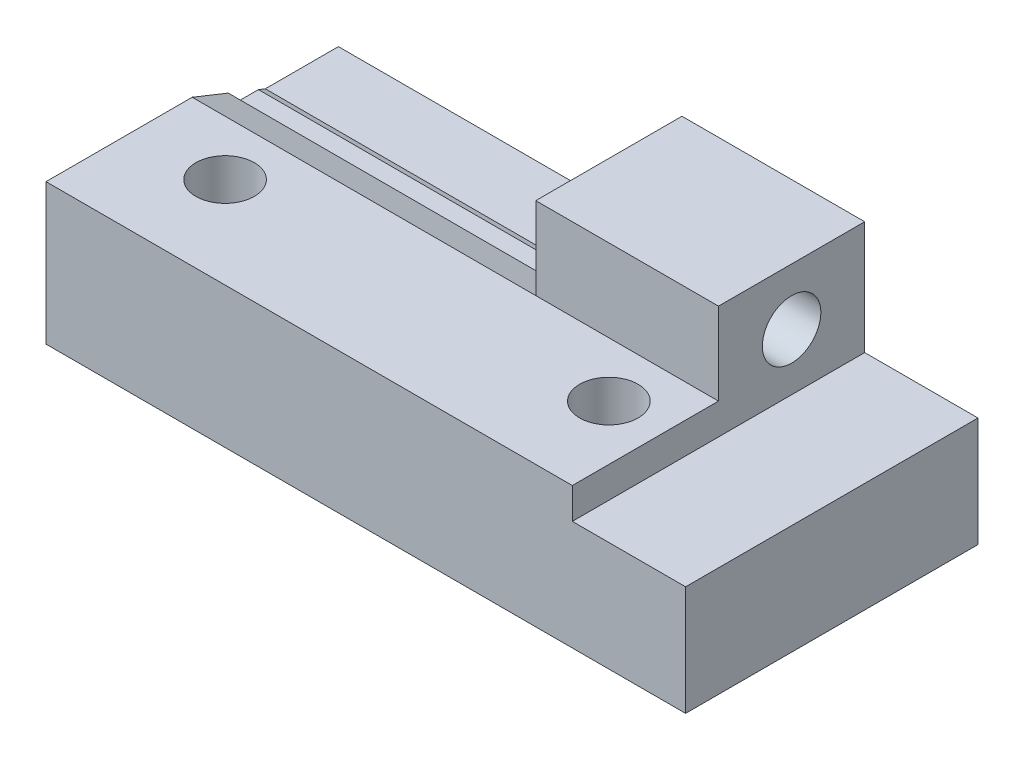
ISO-10303-21;
HEADER;
FILE_DESCRIPTION(('STEP AP214'),'2;1');
FILE_NAME('part.step','',(''),(''),'','','');
FILE_SCHEMA(('AUTOMOTIVE_DESIGN { 1 0 10303 214 1 1 1 1 }'));
ENDSEC;
DATA;
#1=APPLICATION_CONTEXT('core data for automotive mechanical design processes');
#2=APPLICATION_PROTOCOL_DEFINITION('international standard','automotive_design',2000,#1);
#3=PRODUCT_CONTEXT('',#1,'mechanical');
#4=PRODUCT('Part','Part','',(#3));
#5=PRODUCT_RELATED_PRODUCT_CATEGORY('part','',(#4));
#6=PRODUCT_DEFINITION_FORMATION('','',#4);
#7=PRODUCT_DEFINITION_CONTEXT('part definition',#1,'design');
#8=PRODUCT_DEFINITION('design','',#6,#7);
#9=PRODUCT_DEFINITION_SHAPE('','',#8);
#10=(LENGTH_UNIT() NAMED_UNIT(*) SI_UNIT(.MILLI.,.METRE.));
#11=(NAMED_UNIT(*) PLANE_ANGLE_UNIT() SI_UNIT($,.RADIAN.));
#12=(NAMED_UNIT(*) SI_UNIT($,.STERADIAN.) SOLID_ANGLE_UNIT());
#13=UNCERTAINTY_MEASURE_WITH_UNIT(LENGTH_MEASURE(1.E-05),#10,'distance_accuracy_value','');
#14=(GEOMETRIC_REPRESENTATION_CONTEXT(3) GLOBAL_UNCERTAINTY_ASSIGNED_CONTEXT((#13)) GLOBAL_UNIT_ASSIGNED_CONTEXT((#10,
#11,#12)) REPRESENTATION_CONTEXT('',''));
#15=CARTESIAN_POINT('',(0.,0.,0.));
#16=DIRECTION('',(0.,0.,1.));
#17=DIRECTION('',(1.,0.,0.));
#18=AXIS2_PLACEMENT_3D('',#15,#16,#17);
#19=CARTESIAN_POINT('',(-35.00105,9.1,4.));
#20=DIRECTION('',(1.,0.,0.));
#21=DIRECTION('',(0.,1.,0.));
#22=AXIS2_PLACEMENT_3D('',#19,#20,#21);
#23=CYLINDRICAL_SURFACE('',#22,1.6);
#24=CARTESIAN_POINT('',(-6.2,9.1,4.));
#25=DIRECTION('',(1.,0.,0.));
#26=DIRECTION('',(0.,1.,0.));
#27=AXIS2_PLACEMENT_3D('',#24,#25,#26);
#28=CIRCLE('',#27,1.6);
#29=CARTESIAN_POINT('',(-6.2,10.7,4.));
#30=VERTEX_POINT('',#29);
#31=EDGE_CURVE('E450',#30,#30,#28,.T.);
#32=ORIENTED_EDGE('',*,*,#31,.T.);
#33=EDGE_LOOP('',(#32));
#34=FACE_BOUND('',#33,.T.);
#35=CARTESIAN_POINT('',(-13.2,9.1,4.));
#36=DIRECTION('',(-1.,0.,0.));
#37=DIRECTION('',(0.,0.,1.));
#38=AXIS2_PLACEMENT_3D('',#35,#36,#37);
#39=CIRCLE('',#38,1.6);
#40=CARTESIAN_POINT('',(-13.2,9.1,5.6));
#41=VERTEX_POINT('',#40);
#42=EDGE_CURVE('E36',#41,#41,#39,.F.);
#43=ORIENTED_EDGE('',*,*,#42,.F.);
#44=EDGE_LOOP('',(#43));
#45=FACE_BOUND('',#44,.T.);
#46=ADVANCED_FACE('F32',(#34,#45),#23,.F.);
#47=CARTESIAN_POINT('',(-35.,12.2,8.));
#48=DIRECTION('',(1.,0.,0.));
#49=DIRECTION('',(0.,0.,-1.));
#50=AXIS2_PLACEMENT_3D('',#47,#48,#49);
#51=PLANE('',#50);
#52=DIRECTION('',(0.,0.,-1.));
#53=VECTOR('',#52,1.);
#54=CARTESIAN_POINT('',(-35.,6.25,2.35455173280956));
#55=LINE('',#54,#53);
#56=CARTESIAN_POINT('',(-35.,6.25,5.64544826719044));
#57=VERTEX_POINT('',#56);
#58=CARTESIAN_POINT('',(-35.,6.25,4.375));
#59=VERTEX_POINT('',#58);
#60=EDGE_CURVE('E287',#57,#59,#55,.T.);
#61=ORIENTED_EDGE('',*,*,#60,.T.);
#62=DIRECTION('',(0.,0.371390676354103,0.92847669088526));
#63=VECTOR('',#62,1.);
#64=CARTESIAN_POINT('',(-35.,7.7,8.));
#65=LINE('',#64,#63);
#66=CARTESIAN_POINT('',(-35.,6.1,4.));
#67=VERTEX_POINT('',#66);
#68=EDGE_CURVE('E324',#67,#59,#65,.T.);
#69=ORIENTED_EDGE('',*,*,#68,.F.);
#70=DIRECTION('',(0.,0.,1.));
#71=VECTOR('',#70,1.);
#72=CARTESIAN_POINT('',(-35.,6.1,4.));
#73=LINE('',#72,#71);
#74=CARTESIAN_POINT('',(-35.,6.1,0.));
#75=VERTEX_POINT('',#74);
#76=EDGE_CURVE('E328',#75,#67,#73,.T.);
#77=ORIENTED_EDGE('',*,*,#76,.F.);
#78=DIRECTION('',(0.,-1.,0.));
#79=VECTOR('',#78,1.);
#80=CARTESIAN_POINT('',(-35.,12.2,0.));
#81=LINE('',#80,#79);
#82=CARTESIAN_POINT('',(-35.,0.,0.));
#83=VERTEX_POINT('',#82);
#84=EDGE_CURVE('E581',#75,#83,#81,.T.);
#85=ORIENTED_EDGE('',*,*,#84,.T.);
#86=DIRECTION('',(0.,0.,-1.));
#87=VECTOR('',#86,1.);
#88=CARTESIAN_POINT('',(-35.,0.,8.));
#89=LINE('',#88,#87);
#90=CARTESIAN_POINT('',(-35.,0.,16.));
#91=VERTEX_POINT('',#90);
#92=EDGE_CURVE('E583',#91,#83,#89,.T.);
#93=ORIENTED_EDGE('',*,*,#92,.F.);
#94=DIRECTION('',(0.,-1.,0.));
#95=VECTOR('',#94,1.);
#96=CARTESIAN_POINT('',(-35.,7.7,16.));
#97=LINE('',#96,#95);
#98=CARTESIAN_POINT('',(-35.,7.7,16.));
#99=VERTEX_POINT('',#98);
#100=EDGE_CURVE('E454',#99,#91,#97,.T.);
#101=ORIENTED_EDGE('',*,*,#100,.F.);
#102=DIRECTION('',(0.,0.,-1.));
#103=VECTOR('',#102,1.);
#104=CARTESIAN_POINT('',(-35.,7.7,16.));
#105=LINE('',#104,#103);
#106=CARTESIAN_POINT('',(-35.,7.7,8.));
#107=VERTEX_POINT('',#106);
#108=EDGE_CURVE('E470',#99,#107,#105,.T.);
#109=ORIENTED_EDGE('',*,*,#108,.T.);
#110=CARTESIAN_POINT('',(-35.,6.91077988456844,6.02694971142112));
#111=VERTEX_POINT('',#110);
#112=EDGE_CURVE('E327',#111,#107,#65,.T.);
#113=ORIENTED_EDGE('',*,*,#112,.F.);
#114=DIRECTION('',(0.,-0.866025403784439,-0.5));
#115=VECTOR('',#114,1.);
#116=CARTESIAN_POINT('',(-35.,6.25,5.64544826719044));
#117=LINE('',#116,#115);
#118=EDGE_CURVE('E49',#111,#57,#117,.T.);
#119=ORIENTED_EDGE('',*,*,#118,.T.);
#120=EDGE_LOOP('',(#61,#69,#77,#85,#93,#101,#109,#113,#119));
#121=FACE_BOUND('',#120,.T.);
#122=ADVANCED_FACE('F514',(#121),#51,.F.);
#123=CARTESIAN_POINT('',(-16.2,6.,8.));
#124=DIRECTION('',(-1.,0.,0.));
#125=DIRECTION('',(0.,-1.,0.));
#126=AXIS2_PLACEMENT_3D('',#123,#124,#125);
#127=PLANE('',#126);
#128=DIRECTION('',(0.,0.866025403784439,-0.5));
#129=VECTOR('',#128,1.);
#130=CARTESIAN_POINT('',(-16.2,9.1,7.29089653438087));
#131=LINE('',#130,#129);
#132=CARTESIAN_POINT('',(-16.2,9.1,7.29089653438087));
#133=VERTEX_POINT('',#132);
#134=CARTESIAN_POINT('',(-16.2,11.95,5.64544826719043));
#135=VERTEX_POINT('',#134);
#136=EDGE_CURVE('E264',#133,#135,#131,.T.);
#137=ORIENTED_EDGE('',*,*,#136,.F.);
#138=DIRECTION('',(0.,0.866025403784439,0.5));
#139=VECTOR('',#138,1.);
#140=CARTESIAN_POINT('',(-16.2,6.25,5.64544826719044));
#141=LINE('',#140,#139);
#142=CARTESIAN_POINT('',(-16.2,6.91077988456844,6.02694971142112));
#143=VERTEX_POINT('',#142);
#144=EDGE_CURVE('E284',#143,#133,#141,.T.);
#145=ORIENTED_EDGE('',*,*,#144,.F.);
#146=DIRECTION('',(0.,-0.371390676354103,-0.92847669088526));
#147=VECTOR('',#146,1.);
#148=CARTESIAN_POINT('',(-16.2,7.7,8.));
#149=LINE('',#148,#147);
#150=CARTESIAN_POINT('',(-16.2,7.7,8.));
#151=VERTEX_POINT('',#150);
#152=EDGE_CURVE('E314',#151,#143,#149,.T.);
#153=ORIENTED_EDGE('',*,*,#152,.F.);
#154=DIRECTION('',(0.,-1.,0.));
#155=VECTOR('',#154,1.);
#156=CARTESIAN_POINT('',(-16.2,7.69999999999999,8.));
#157=LINE('',#156,#155);
#158=CARTESIAN_POINT('',(-16.2,12.2,8.));
#159=VERTEX_POINT('',#158);
#160=EDGE_CURVE('E309',#159,#151,#157,.T.);
#161=ORIENTED_EDGE('',*,*,#160,.F.);
#162=DIRECTION('',(0.,0.,1.));
#163=VECTOR('',#162,1.);
#164=CARTESIAN_POINT('',(-16.2,12.2,8.));
#165=LINE('',#164,#163);
#166=CARTESIAN_POINT('',(-16.2,12.2,0.));
#167=VERTEX_POINT('',#166);
#168=EDGE_CURVE('E342',#167,#159,#165,.T.);
#169=ORIENTED_EDGE('',*,*,#168,.F.);
#170=DIRECTION('',(0.,1.,0.));
#171=VECTOR('',#170,1.);
#172=CARTESIAN_POINT('',(-16.2,12.2,0.));
#173=LINE('',#172,#171);
#174=CARTESIAN_POINT('',(-16.2,6.1,0.));
#175=VERTEX_POINT('',#174);
#176=EDGE_CURVE('E345',#175,#167,#173,.T.);
#177=ORIENTED_EDGE('',*,*,#176,.F.);
#178=DIRECTION('',(0.,0.,-1.));
#179=VECTOR('',#178,1.);
#180=CARTESIAN_POINT('',(-16.2,6.1,4.));
#181=LINE('',#180,#179);
#182=CARTESIAN_POINT('',(-16.2,6.1,4.));
#183=VERTEX_POINT('',#182);
#184=EDGE_CURVE('E303',#183,#175,#181,.T.);
#185=ORIENTED_EDGE('',*,*,#184,.F.);
#186=CARTESIAN_POINT('',(-16.2,6.25,4.37500000000001));
#187=VERTEX_POINT('',#186);
#188=EDGE_CURVE('E305',#187,#183,#149,.T.);
#189=ORIENTED_EDGE('',*,*,#188,.F.);
#190=DIRECTION('',(0.,0.,1.));
#191=VECTOR('',#190,1.);
#192=CARTESIAN_POINT('',(-16.2,6.25,2.35455173280956));
#193=LINE('',#192,#191);
#194=CARTESIAN_POINT('',(-16.2,6.25,2.35455173280956));
#195=VERTEX_POINT('',#194);
#196=EDGE_CURVE('E277',#195,#187,#193,.T.);
#197=ORIENTED_EDGE('',*,*,#196,.F.);
#198=DIRECTION('',(0.,-0.866025403784439,0.5));
#199=VECTOR('',#198,1.);
#200=CARTESIAN_POINT('',(-16.2,9.1,0.709103465619133));
#201=LINE('',#200,#199);
#202=CARTESIAN_POINT('',(-16.2,9.1,0.709103465619133));
#203=VERTEX_POINT('',#202);
#204=EDGE_CURVE('E275',#203,#195,#201,.T.);
#205=ORIENTED_EDGE('',*,*,#204,.F.);
#206=DIRECTION('',(0.,-0.866025403784439,-0.5));
#207=VECTOR('',#206,1.);
#208=CARTESIAN_POINT('',(-16.2,11.95,2.35455173280957));
#209=LINE('',#208,#207);
#210=CARTESIAN_POINT('',(-16.2,11.95,2.35455173280957));
#211=VERTEX_POINT('',#210);
#212=EDGE_CURVE('E242',#211,#203,#209,.T.);
#213=ORIENTED_EDGE('',*,*,#212,.F.);
#214=DIRECTION('',(0.,0.,-1.));
#215=VECTOR('',#214,1.);
#216=CARTESIAN_POINT('',(-16.2,11.95,5.64544826719043));
#217=LINE('',#216,#215);
#218=EDGE_CURVE('E261',#135,#211,#217,.T.);
#219=ORIENTED_EDGE('',*,*,#218,.F.);
#220=EDGE_LOOP('',(#137,#145,#153,#161,#169,#177,#185,#189,#197,#205,#213,#219));
#221=FACE_BOUND('',#220,.T.);
#222=ADVANCED_FACE('F521',(#221),#127,.T.);
#223=CARTESIAN_POINT('',(3.86031808642252,7.7,8.));
#224=DIRECTION('',(0.,-0.92847669088526,0.371390676354103));
#225=DIRECTION('',(0.,-0.371390676354103,-0.92847669088526));
#226=AXIS2_PLACEMENT_3D('',#223,#224,#225);
#227=PLANE('',#226);
#228=DIRECTION('',(1.,0.,0.));
#229=VECTOR('',#228,1.);
#230=CARTESIAN_POINT('',(-35.00105,6.25,4.375));
#231=LINE('',#230,#229);
#232=EDGE_CURVE('E291',#59,#187,#231,.T.);
#233=ORIENTED_EDGE('',*,*,#232,.T.);
#234=ORIENTED_EDGE('',*,*,#188,.T.);
#235=DIRECTION('',(-1.,0.,0.));
#236=VECTOR('',#235,1.);
#237=CARTESIAN_POINT('',(3.86031808642252,6.1,4.));
#238=LINE('',#237,#236);
#239=EDGE_CURVE('E321',#183,#67,#238,.T.);
#240=ORIENTED_EDGE('',*,*,#239,.T.);
#241=ORIENTED_EDGE('',*,*,#68,.T.);
#242=EDGE_LOOP('',(#233,#234,#240,#241));
#243=FACE_BOUND('',#242,.T.);
#244=ADVANCED_FACE('F616',(#243),#227,.F.);
#245=DIRECTION('',(-1.,0.,0.));
#246=VECTOR('',#245,1.);
#247=CARTESIAN_POINT('',(-35.00105,6.91077988456844,6.02694971142112));
#248=LINE('',#247,#246);
#249=EDGE_CURVE('E294',#143,#111,#248,.T.);
#250=ORIENTED_EDGE('',*,*,#249,.T.);
#251=ORIENTED_EDGE('',*,*,#112,.T.);
#252=DIRECTION('',(-1.,0.,0.));
#253=VECTOR('',#252,1.);
#254=CARTESIAN_POINT('',(3.86031808642252,7.7,8.));
#255=LINE('',#254,#253);
#256=EDGE_CURVE('E306',#151,#107,#255,.T.);
#257=ORIENTED_EDGE('',*,*,#256,.F.);
#258=ORIENTED_EDGE('',*,*,#152,.T.);
#259=EDGE_LOOP('',(#250,#251,#257,#258));
#260=FACE_BOUND('',#259,.T.);
#261=ADVANCED_FACE('F542',(#260),#227,.F.);
#262=CARTESIAN_POINT('',(-6.2,12.2,8.));
#263=DIRECTION('',(0.,-1.,0.));
#264=DIRECTION('',(1.,0.,0.));
#265=AXIS2_PLACEMENT_3D('',#262,#263,#264);
#266=PLANE('',#265);
#267=ORIENTED_EDGE('',*,*,#168,.T.);
#268=DIRECTION('',(-1.,0.,0.));
#269=VECTOR('',#268,1.);
#270=CARTESIAN_POINT('',(-6.2,12.2,8.));
#271=LINE('',#270,#269);
#272=CARTESIAN_POINT('',(-6.2,12.2,8.));
#273=VERTEX_POINT('',#272);
#274=EDGE_CURVE('E587',#273,#159,#271,.T.);
#275=ORIENTED_EDGE('',*,*,#274,.F.);
#276=DIRECTION('',(0.,0.,-1.));
#277=VECTOR('',#276,1.);
#278=CARTESIAN_POINT('',(-6.2,12.2,8.));
#279=LINE('',#278,#277);
#280=CARTESIAN_POINT('',(-6.2,12.2,0.));
#281=VERTEX_POINT('',#280);
#282=EDGE_CURVE('E586',#273,#281,#279,.T.);
#283=ORIENTED_EDGE('',*,*,#282,.T.);
#284=DIRECTION('',(-1.,0.,0.));
#285=VECTOR('',#284,1.);
#286=CARTESIAN_POINT('',(-6.2,12.2,0.));
#287=LINE('',#286,#285);
#288=EDGE_CURVE('E575',#281,#167,#287,.T.);
#289=ORIENTED_EDGE('',*,*,#288,.T.);
#290=EDGE_LOOP('',(#267,#275,#283,#289));
#291=FACE_BOUND('',#290,.T.);
#292=ADVANCED_FACE('F509',(#291),#266,.F.);
#293=CARTESIAN_POINT('',(0.,0.,8.));
#294=DIRECTION('',(0.,0.,1.));
#295=DIRECTION('',(1.,0.,0.));
#296=AXIS2_PLACEMENT_3D('',#293,#294,#295);
#297=PLANE('',#296);
#298=ORIENTED_EDGE('',*,*,#274,.T.);
#299=ORIENTED_EDGE('',*,*,#160,.T.);
#300=DIRECTION('',(-1.,0.,0.));
#301=VECTOR('',#300,1.);
#302=CARTESIAN_POINT('',(-6.2,7.7,8.));
#303=LINE('',#302,#301);
#304=CARTESIAN_POINT('',(-6.2,7.7,8.));
#305=VERTEX_POINT('',#304);
#306=EDGE_CURVE('E453',#305,#151,#303,.T.);
#307=ORIENTED_EDGE('',*,*,#306,.F.);
#308=DIRECTION('',(0.,1.,0.));
#309=VECTOR('',#308,1.);
#310=CARTESIAN_POINT('',(-6.2,6.,8.));
#311=LINE('',#310,#309);
#312=EDGE_CURVE('E479',#305,#273,#311,.T.);
#313=ORIENTED_EDGE('',*,*,#312,.T.);
#314=EDGE_LOOP('',(#298,#299,#307,#313));
#315=FACE_BOUND('',#314,.T.);
#316=ADVANCED_FACE('F499',(#315),#297,.T.);
#317=CARTESIAN_POINT('',(-9.2,-0.001000000000001,11.));
#318=DIRECTION('',(0.,1.,0.));
#319=DIRECTION('',(-1.,0.,0.));
#320=AXIS2_PLACEMENT_3D('',#317,#318,#319);
#321=CYLINDRICAL_SURFACE('',#320,1.6);
#322=CARTESIAN_POINT('',(-9.2,7.7,11.));
#323=DIRECTION('',(0.,1.,0.));
#324=DIRECTION('',(-1.,0.,0.));
#325=AXIS2_PLACEMENT_3D('',#322,#323,#324);
#326=CIRCLE('',#325,1.6);
#327=CARTESIAN_POINT('',(-10.8,7.7,11.));
#328=VERTEX_POINT('',#327);
#329=EDGE_CURVE('E444',#328,#328,#326,.T.);
#330=ORIENTED_EDGE('',*,*,#329,.T.);
#331=EDGE_LOOP('',(#330));
#332=FACE_BOUND('',#331,.T.);
#333=CARTESIAN_POINT('',(-9.2,3.,11.));
#334=DIRECTION('',(0.,-1.,0.));
#335=DIRECTION('',(0.,0.,-1.));
#336=AXIS2_PLACEMENT_3D('',#333,#334,#335);
#337=CIRCLE('',#336,1.6);
#338=CARTESIAN_POINT('',(-9.2,3.,9.4));
#339=VERTEX_POINT('',#338);
#340=EDGE_CURVE('E385',#339,#339,#337,.F.);
#341=ORIENTED_EDGE('',*,*,#340,.F.);
#342=EDGE_LOOP('',(#341));
#343=FACE_BOUND('',#342,.T.);
#344=ADVANCED_FACE('F496',(#332,#343),#321,.F.);
#345=CARTESIAN_POINT('',(-30.2,-0.0010000000000036,11.));
#346=DIRECTION('',(0.,1.,0.));
#347=DIRECTION('',(-1.,0.,0.));
#348=AXIS2_PLACEMENT_3D('',#345,#346,#347);
#349=CYLINDRICAL_SURFACE('',#348,1.6);
#350=CARTESIAN_POINT('',(-30.2,7.7,11.));
#351=DIRECTION('',(0.,1.,0.));
#352=DIRECTION('',(-1.,0.,0.));
#353=AXIS2_PLACEMENT_3D('',#350,#351,#352);
#354=CIRCLE('',#353,1.6);
#355=CARTESIAN_POINT('',(-31.8,7.7,11.));
#356=VERTEX_POINT('',#355);
#357=EDGE_CURVE('E447',#356,#356,#354,.T.);
#358=ORIENTED_EDGE('',*,*,#357,.T.);
#359=EDGE_LOOP('',(#358));
#360=FACE_BOUND('',#359,.T.);
#361=CARTESIAN_POINT('',(-30.2,3.,11.));
#362=DIRECTION('',(0.,-1.,0.));
#363=DIRECTION('',(0.,0.,-1.));
#364=AXIS2_PLACEMENT_3D('',#361,#362,#363);
#365=CIRCLE('',#364,1.6);
#366=CARTESIAN_POINT('',(-30.2,3.,9.4));
#367=VERTEX_POINT('',#366);
#368=EDGE_CURVE('E433',#367,#367,#365,.F.);
#369=ORIENTED_EDGE('',*,*,#368,.F.);
#370=EDGE_LOOP('',(#369));
#371=FACE_BOUND('',#370,.T.);
#372=ADVANCED_FACE('F498',(#360,#371),#349,.F.);
#373=CARTESIAN_POINT('',(-35.,0.,8.));
#374=DIRECTION('',(0.,1.,0.));
#375=DIRECTION('',(0.,0.,1.));
#376=AXIS2_PLACEMENT_3D('',#373,#374,#375);
#377=PLANE('',#376);
#378=DIRECTION('',(0.5,0.,-0.866025403784439));
#379=VECTOR('',#378,1.);
#380=CARTESIAN_POINT('',(-12.4908965343809,0.,11.));
#381=LINE('',#380,#379);
#382=CARTESIAN_POINT('',(-12.4908965343809,0.,11.));
#383=VERTEX_POINT('',#382);
#384=CARTESIAN_POINT('',(-10.8454482671904,0.,8.15));
#385=VERTEX_POINT('',#384);
#386=EDGE_CURVE('E369',#383,#385,#381,.T.);
#387=ORIENTED_EDGE('',*,*,#386,.F.);
#388=DIRECTION('',(-0.499999999999999,0.,-0.866025403784439));
#389=VECTOR('',#388,1.);
#390=CARTESIAN_POINT('',(-10.8454482671904,0.,13.85));
#391=LINE('',#390,#389);
#392=CARTESIAN_POINT('',(-10.8454482671904,0.,13.85));
#393=VERTEX_POINT('',#392);
#394=EDGE_CURVE('E57',#393,#383,#391,.T.);
#395=ORIENTED_EDGE('',*,*,#394,.F.);
#396=DIRECTION('',(-1.,0.,0.));
#397=VECTOR('',#396,1.);
#398=CARTESIAN_POINT('',(-7.55455173280957,0.,13.85));
#399=LINE('',#398,#397);
#400=CARTESIAN_POINT('',(-7.55455173280957,0.,13.85));
#401=VERTEX_POINT('',#400);
#402=EDGE_CURVE('E352',#401,#393,#399,.T.);
#403=ORIENTED_EDGE('',*,*,#402,.F.);
#404=DIRECTION('',(-0.5,0.,0.866025403784438));
#405=VECTOR('',#404,1.);
#406=CARTESIAN_POINT('',(-5.90910346561914,0.,11.));
#407=LINE('',#406,#405);
#408=CARTESIAN_POINT('',(-5.90910346561914,0.,11.));
#409=VERTEX_POINT('',#408);
#410=EDGE_CURVE('E378',#409,#401,#407,.T.);
#411=ORIENTED_EDGE('',*,*,#410,.F.);
#412=DIRECTION('',(0.5,0.,0.866025403784439));
#413=VECTOR('',#412,1.);
#414=CARTESIAN_POINT('',(-7.55455173280957,0.,8.15));
#415=LINE('',#414,#413);
#416=CARTESIAN_POINT('',(-7.55455173280957,0.,8.15));
#417=VERTEX_POINT('',#416);
#418=EDGE_CURVE('E375',#417,#409,#415,.T.);
#419=ORIENTED_EDGE('',*,*,#418,.F.);
#420=DIRECTION('',(1.,0.,0.));
#421=VECTOR('',#420,1.);
#422=CARTESIAN_POINT('',(-10.8454482671904,0.,8.15));
#423=LINE('',#422,#421);
#424=EDGE_CURVE('E372',#385,#417,#423,.T.);
#425=ORIENTED_EDGE('',*,*,#424,.F.);
#426=EDGE_LOOP('',(#387,#395,#403,#411,#419,#425));
#427=FACE_BOUND('',#426,.T.);
#428=DIRECTION('',(0.500000000000001,0.,-0.866025403784438));
#429=VECTOR('',#428,1.);
#430=CARTESIAN_POINT('',(-33.4908965343809,0.,11.));
#431=LINE('',#430,#429);
#432=CARTESIAN_POINT('',(-33.4908965343809,0.,11.));
#433=VERTEX_POINT('',#432);
#434=CARTESIAN_POINT('',(-31.8454482671904,0.,8.15));
#435=VERTEX_POINT('',#434);
#436=EDGE_CURVE('E417',#433,#435,#431,.T.);
#437=ORIENTED_EDGE('',*,*,#436,.F.);
#438=DIRECTION('',(-0.499999999999999,0.,-0.866025403784439));
#439=VECTOR('',#438,1.);
#440=CARTESIAN_POINT('',(-31.8454482671904,0.,13.85));
#441=LINE('',#440,#439);
#442=CARTESIAN_POINT('',(-31.8454482671904,0.,13.85));
#443=VERTEX_POINT('',#442);
#444=EDGE_CURVE('E415',#443,#433,#441,.T.);
#445=ORIENTED_EDGE('',*,*,#444,.F.);
#446=DIRECTION('',(-1.,0.,0.));
#447=VECTOR('',#446,1.);
#448=CARTESIAN_POINT('',(-28.5545517328096,0.,13.85));
#449=LINE('',#448,#447);
#450=CARTESIAN_POINT('',(-28.5545517328096,0.,13.85));
#451=VERTEX_POINT('',#450);
#452=EDGE_CURVE('E399',#451,#443,#449,.T.);
#453=ORIENTED_EDGE('',*,*,#452,.F.);
#454=DIRECTION('',(-0.500000000000001,0.,0.866025403784438));
#455=VECTOR('',#454,1.);
#456=CARTESIAN_POINT('',(-26.9091034656191,0.,11.));
#457=LINE('',#456,#455);
#458=CARTESIAN_POINT('',(-26.9091034656191,0.,11.));
#459=VERTEX_POINT('',#458);
#460=EDGE_CURVE('E426',#459,#451,#457,.T.);
#461=ORIENTED_EDGE('',*,*,#460,.F.);
#462=DIRECTION('',(0.5,0.,0.866025403784438));
#463=VECTOR('',#462,1.);
#464=CARTESIAN_POINT('',(-28.5545517328096,0.,8.15));
#465=LINE('',#464,#463);
#466=CARTESIAN_POINT('',(-28.5545517328096,0.,8.15));
#467=VERTEX_POINT('',#466);
#468=EDGE_CURVE('E423',#467,#459,#465,.T.);
#469=ORIENTED_EDGE('',*,*,#468,.F.);
#470=DIRECTION('',(1.,0.,0.));
#471=VECTOR('',#470,1.);
#472=CARTESIAN_POINT('',(-31.8454482671904,0.,8.15));
#473=LINE('',#472,#471);
#474=EDGE_CURVE('E420',#435,#467,#473,.T.);
#475=ORIENTED_EDGE('',*,*,#474,.F.);
#476=EDGE_LOOP('',(#437,#445,#453,#461,#469,#475));
#477=FACE_BOUND('',#476,.T.);
#478=DIRECTION('',(1.,0.,0.));
#479=VECTOR('',#478,1.);
#480=CARTESIAN_POINT('',(-35.,0.,0.));
#481=LINE('',#480,#479);
#482=CARTESIAN_POINT('',(0.,0.,0.));
#483=VERTEX_POINT('',#482);
#484=EDGE_CURVE('E487',#83,#483,#481,.T.);
#485=ORIENTED_EDGE('',*,*,#484,.T.);
#486=DIRECTION('',(0.,0.,-1.));
#487=VECTOR('',#486,1.);
#488=CARTESIAN_POINT('',(0.,0.,8.));
#489=LINE('',#488,#487);
#490=CARTESIAN_POINT('',(0.,0.,16.));
#491=VERTEX_POINT('',#490);
#492=EDGE_CURVE('E12',#491,#483,#489,.T.);
#493=ORIENTED_EDGE('',*,*,#492,.F.);
#494=DIRECTION('',(1.,0.,0.));
#495=VECTOR('',#494,1.);
#496=CARTESIAN_POINT('',(-35.,0.,16.));
#497=LINE('',#496,#495);
#498=EDGE_CURVE('E457',#91,#491,#497,.T.);
#499=ORIENTED_EDGE('',*,*,#498,.F.);
#500=ORIENTED_EDGE('',*,*,#92,.T.);
#501=EDGE_LOOP('',(#485,#493,#499,#500));
#502=FACE_BOUND('',#501,.T.);
#503=ADVANCED_FACE('F34',(#427,#477,#502),#377,.F.);
#504=CARTESIAN_POINT('',(0.,0.,8.));
#505=DIRECTION('',(-1.,0.,0.));
#506=DIRECTION('',(0.,0.,1.));
#507=AXIS2_PLACEMENT_3D('',#504,#505,#506);
#508=PLANE('',#507);
#509=DIRECTION('',(0.,1.,0.));
#510=VECTOR('',#509,1.);
#511=CARTESIAN_POINT('',(0.,0.,0.));
#512=LINE('',#511,#510);
#513=CARTESIAN_POINT('',(0.,6.,0.));
#514=VERTEX_POINT('',#513);
#515=EDGE_CURVE('E558',#483,#514,#512,.T.);
#516=ORIENTED_EDGE('',*,*,#515,.T.);
#517=DIRECTION('',(0.,0.,-1.));
#518=VECTOR('',#517,1.);
#519=CARTESIAN_POINT('',(0.,6.,8.));
#520=LINE('',#519,#518);
#521=CARTESIAN_POINT('',(0.,6.,16.));
#522=VERTEX_POINT('',#521);
#523=EDGE_CURVE('E41',#522,#514,#520,.T.);
#524=ORIENTED_EDGE('',*,*,#523,.F.);
#525=DIRECTION('',(0.,1.,0.));
#526=VECTOR('',#525,1.);
#527=CARTESIAN_POINT('',(0.,0.,16.));
#528=LINE('',#527,#526);
#529=EDGE_CURVE('E460',#491,#522,#528,.T.);
#530=ORIENTED_EDGE('',*,*,#529,.F.);
#531=ORIENTED_EDGE('',*,*,#492,.T.);
#532=EDGE_LOOP('',(#516,#524,#530,#531));
#533=FACE_BOUND('',#532,.T.);
#534=ADVANCED_FACE('F549',(#533),#508,.F.);
#535=CARTESIAN_POINT('',(0.,6.,8.));
#536=DIRECTION('',(0.,-1.,0.));
#537=DIRECTION('',(1.,0.,0.));
#538=AXIS2_PLACEMENT_3D('',#535,#536,#537);
#539=PLANE('',#538);
#540=DIRECTION('',(-1.,0.,0.));
#541=VECTOR('',#540,1.);
#542=CARTESIAN_POINT('',(0.,6.,0.));
#543=LINE('',#542,#541);
#544=CARTESIAN_POINT('',(-6.2,6.,0.));
#545=VERTEX_POINT('',#544);
#546=EDGE_CURVE('E564',#514,#545,#543,.T.);
#547=ORIENTED_EDGE('',*,*,#546,.T.);
#548=DIRECTION('',(0.,0.,-1.));
#549=VECTOR('',#548,1.);
#550=CARTESIAN_POINT('',(-6.2,6.,8.));
#551=LINE('',#550,#549);
#552=CARTESIAN_POINT('',(-6.2,6.,16.));
#553=VERTEX_POINT('',#552);
#554=EDGE_CURVE('E568',#553,#545,#551,.T.);
#555=ORIENTED_EDGE('',*,*,#554,.F.);
#556=DIRECTION('',(-1.,0.,0.));
#557=VECTOR('',#556,1.);
#558=CARTESIAN_POINT('',(0.,6.,16.));
#559=LINE('',#558,#557);
#560=EDGE_CURVE('E463',#522,#553,#559,.T.);
#561=ORIENTED_EDGE('',*,*,#560,.F.);
#562=ORIENTED_EDGE('',*,*,#523,.T.);
#563=EDGE_LOOP('',(#547,#555,#561,#562));
#564=FACE_BOUND('',#563,.T.);
#565=ADVANCED_FACE('F546',(#564),#539,.F.);
#566=CARTESIAN_POINT('',(-6.2,6.,8.));
#567=DIRECTION('',(-1.,0.,0.));
#568=DIRECTION('',(0.,-1.,0.));
#569=AXIS2_PLACEMENT_3D('',#566,#567,#568);
#570=PLANE('',#569);
#571=ORIENTED_EDGE('',*,*,#31,.F.);
#572=EDGE_LOOP('',(#571));
#573=FACE_BOUND('',#572,.T.);
#574=DIRECTION('',(0.,1.,0.));
#575=VECTOR('',#574,1.);
#576=CARTESIAN_POINT('',(-6.2,6.,0.));
#577=LINE('',#576,#575);
#578=EDGE_CURVE('E573',#545,#281,#577,.T.);
#579=ORIENTED_EDGE('',*,*,#578,.T.);
#580=ORIENTED_EDGE('',*,*,#282,.F.);
#581=ORIENTED_EDGE('',*,*,#312,.F.);
#582=DIRECTION('',(0.,0.,-1.));
#583=VECTOR('',#582,1.);
#584=CARTESIAN_POINT('',(-6.2,7.7,16.));
#585=LINE('',#584,#583);
#586=CARTESIAN_POINT('',(-6.2,7.7,16.));
#587=VERTEX_POINT('',#586);
#588=EDGE_CURVE('E482',#587,#305,#585,.T.);
#589=ORIENTED_EDGE('',*,*,#588,.F.);
#590=DIRECTION('',(0.,1.,0.));
#591=VECTOR('',#590,1.);
#592=CARTESIAN_POINT('',(-6.2,6.,16.));
#593=LINE('',#592,#591);
#594=EDGE_CURVE('E466',#553,#587,#593,.T.);
#595=ORIENTED_EDGE('',*,*,#594,.F.);
#596=ORIENTED_EDGE('',*,*,#554,.T.);
#597=EDGE_LOOP('',(#579,#580,#581,#589,#595,#596));
#598=FACE_BOUND('',#597,.T.);
#599=ADVANCED_FACE('F537',(#573,#598),#570,.F.);
#600=CARTESIAN_POINT('',(0.,0.,0.));
#601=DIRECTION('',(0.,0.,1.));
#602=DIRECTION('',(1.,0.,0.));
#603=AXIS2_PLACEMENT_3D('',#600,#601,#602);
#604=PLANE('',#603);
#605=ORIENTED_EDGE('',*,*,#84,.F.);
#606=DIRECTION('',(-1.,0.,0.));
#607=VECTOR('',#606,1.);
#608=CARTESIAN_POINT('',(3.86031808642252,6.1,0.));
#609=LINE('',#608,#607);
#610=EDGE_CURVE('E333',#175,#75,#609,.T.);
#611=ORIENTED_EDGE('',*,*,#610,.F.);
#612=ORIENTED_EDGE('',*,*,#176,.T.);
#613=ORIENTED_EDGE('',*,*,#288,.F.);
#614=ORIENTED_EDGE('',*,*,#578,.F.);
#615=ORIENTED_EDGE('',*,*,#546,.F.);
#616=ORIENTED_EDGE('',*,*,#515,.F.);
#617=ORIENTED_EDGE('',*,*,#484,.F.);
#618=EDGE_LOOP('',(#605,#611,#612,#613,#614,#615,#616,#617));
#619=FACE_BOUND('',#618,.T.);
#620=ADVANCED_FACE('F533',(#619),#604,.F.);
#621=CARTESIAN_POINT('',(-6.2,7.7,16.));
#622=DIRECTION('',(0.,-1.,0.));
#623=DIRECTION('',(1.,0.,0.));
#624=AXIS2_PLACEMENT_3D('',#621,#622,#623);
#625=PLANE('',#624);
#626=ORIENTED_EDGE('',*,*,#329,.F.);
#627=EDGE_LOOP('',(#626));
#628=FACE_BOUND('',#627,.T.);
#629=ORIENTED_EDGE('',*,*,#357,.F.);
#630=EDGE_LOOP('',(#629));
#631=FACE_BOUND('',#630,.T.);
#632=ORIENTED_EDGE('',*,*,#306,.T.);
#633=ORIENTED_EDGE('',*,*,#256,.T.);
#634=ORIENTED_EDGE('',*,*,#108,.F.);
#635=DIRECTION('',(-1.,0.,0.));
#636=VECTOR('',#635,1.);
#637=CARTESIAN_POINT('',(-6.2,7.7,16.));
#638=LINE('',#637,#636);
#639=EDGE_CURVE('E468',#587,#99,#638,.T.);
#640=ORIENTED_EDGE('',*,*,#639,.F.);
#641=ORIENTED_EDGE('',*,*,#588,.T.);
#642=EDGE_LOOP('',(#632,#633,#634,#640,#641));
#643=FACE_BOUND('',#642,.T.);
#644=ADVANCED_FACE('F530',(#628,#631,#643),#625,.F.);
#645=CARTESIAN_POINT('',(-35.,0.,16.));
#646=DIRECTION('',(0.,0.,1.));
#647=DIRECTION('',(1.,0.,0.));
#648=AXIS2_PLACEMENT_3D('',#645,#646,#647);
#649=PLANE('',#648);
#650=ORIENTED_EDGE('',*,*,#100,.T.);
#651=ORIENTED_EDGE('',*,*,#498,.T.);
#652=ORIENTED_EDGE('',*,*,#529,.T.);
#653=ORIENTED_EDGE('',*,*,#560,.T.);
#654=ORIENTED_EDGE('',*,*,#594,.T.);
#655=ORIENTED_EDGE('',*,*,#639,.T.);
#656=EDGE_LOOP('',(#650,#651,#652,#653,#654,#655));
#657=FACE_BOUND('',#656,.T.);
#658=ADVANCED_FACE('F526',(#657),#649,.T.);
#659=CARTESIAN_POINT('',(-33.4908965343809,3.,11.));
#660=DIRECTION('',(0.,-1.,0.));
#661=DIRECTION('',(0.,0.,-1.));
#662=AXIS2_PLACEMENT_3D('',#659,#660,#661);
#663=PLANE('',#662);
#664=DIRECTION('',(-0.499999999999999,0.,-0.866025403784439));
#665=VECTOR('',#664,1.);
#666=CARTESIAN_POINT('',(-31.8454482671904,3.,13.85));
#667=LINE('',#666,#665);
#668=CARTESIAN_POINT('',(-31.8454482671904,3.,13.85));
#669=VERTEX_POINT('',#668);
#670=CARTESIAN_POINT('',(-33.4908965343809,3.,11.));
#671=VERTEX_POINT('',#670);
#672=EDGE_CURVE('E395',#669,#671,#667,.T.);
#673=ORIENTED_EDGE('',*,*,#672,.T.);
#674=DIRECTION('',(0.500000000000001,0.,-0.866025403784438));
#675=VECTOR('',#674,1.);
#676=CARTESIAN_POINT('',(-33.4908965343809,3.,11.));
#677=LINE('',#676,#675);
#678=CARTESIAN_POINT('',(-31.8454482671904,3.,8.15));
#679=VERTEX_POINT('',#678);
#680=EDGE_CURVE('E398',#671,#679,#677,.T.);
#681=ORIENTED_EDGE('',*,*,#680,.T.);
#682=DIRECTION('',(1.,0.,0.));
#683=VECTOR('',#682,1.);
#684=CARTESIAN_POINT('',(-31.8454482671904,3.,8.15));
#685=LINE('',#684,#683);
#686=CARTESIAN_POINT('',(-28.5545517328096,3.,8.15));
#687=VERTEX_POINT('',#686);
#688=EDGE_CURVE('E402',#679,#687,#685,.T.);
#689=ORIENTED_EDGE('',*,*,#688,.T.);
#690=DIRECTION('',(0.5,0.,0.866025403784438));
#691=VECTOR('',#690,1.);
#692=CARTESIAN_POINT('',(-28.5545517328096,3.,8.15));
#693=LINE('',#692,#691);
#694=CARTESIAN_POINT('',(-26.9091034656191,3.,11.));
#695=VERTEX_POINT('',#694);
#696=EDGE_CURVE('E405',#687,#695,#693,.T.);
#697=ORIENTED_EDGE('',*,*,#696,.T.);
#698=DIRECTION('',(-0.500000000000001,0.,0.866025403784438));
#699=VECTOR('',#698,1.);
#700=CARTESIAN_POINT('',(-26.9091034656191,3.,11.));
#701=LINE('',#700,#699);
#702=CARTESIAN_POINT('',(-28.5545517328096,3.,13.85));
#703=VERTEX_POINT('',#702);
#704=EDGE_CURVE('E408',#695,#703,#701,.T.);
#705=ORIENTED_EDGE('',*,*,#704,.T.);
#706=DIRECTION('',(-1.,0.,0.));
#707=VECTOR('',#706,1.);
#708=CARTESIAN_POINT('',(-28.5545517328096,3.,13.85));
#709=LINE('',#708,#707);
#710=EDGE_CURVE('E411',#703,#669,#709,.T.);
#711=ORIENTED_EDGE('',*,*,#710,.T.);
#712=EDGE_LOOP('',(#673,#681,#689,#697,#705,#711));
#713=FACE_BOUND('',#712,.T.);
#714=ORIENTED_EDGE('',*,*,#368,.T.);
#715=EDGE_LOOP('',(#714));
#716=FACE_BOUND('',#715,.T.);
#717=ADVANCED_FACE('F529',(#713,#716),#663,.T.);
#718=CARTESIAN_POINT('',(-31.8454482671904,3.,13.85));
#719=DIRECTION('',(-0.866025403784439,0.,0.499999999999999));
#720=DIRECTION('',(0.499999999999999,0.,0.866025403784439));
#721=AXIS2_PLACEMENT_3D('',#718,#719,#720);
#722=PLANE('',#721);
#723=ORIENTED_EDGE('',*,*,#444,.T.);
#724=DIRECTION('',(0.,-1.,0.));
#725=VECTOR('',#724,1.);
#726=CARTESIAN_POINT('',(-33.4908965343809,3.,11.));
#727=LINE('',#726,#725);
#728=EDGE_CURVE('E414',#671,#433,#727,.T.);
#729=ORIENTED_EDGE('',*,*,#728,.F.);
#730=ORIENTED_EDGE('',*,*,#672,.F.);
#731=DIRECTION('',(0.,-1.,0.));
#732=VECTOR('',#731,1.);
#733=CARTESIAN_POINT('',(-31.8454482671904,3.,13.85));
#734=LINE('',#733,#732);
#735=EDGE_CURVE('E431',#669,#443,#734,.T.);
#736=ORIENTED_EDGE('',*,*,#735,.T.);
#737=EDGE_LOOP('',(#723,#729,#730,#736));
#738=FACE_BOUND('',#737,.T.);
#739=ADVANCED_FACE('F658',(#738),#722,.F.);
#740=CARTESIAN_POINT('',(-28.5545517328096,3.,13.85));
#741=DIRECTION('',(0.,0.,1.));
#742=DIRECTION('',(1.,0.,0.));
#743=AXIS2_PLACEMENT_3D('',#740,#741,#742);
#744=PLANE('',#743);
#745=ORIENTED_EDGE('',*,*,#452,.T.);
#746=ORIENTED_EDGE('',*,*,#735,.F.);
#747=ORIENTED_EDGE('',*,*,#710,.F.);
#748=DIRECTION('',(0.,-1.,0.));
#749=VECTOR('',#748,1.);
#750=CARTESIAN_POINT('',(-28.5545517328096,3.,13.85));
#751=LINE('',#750,#749);
#752=EDGE_CURVE('E434',#703,#451,#751,.T.);
#753=ORIENTED_EDGE('',*,*,#752,.T.);
#754=EDGE_LOOP('',(#745,#746,#747,#753));
#755=FACE_BOUND('',#754,.T.);
#756=ADVANCED_FACE('F660',(#755),#744,.F.);
#757=CARTESIAN_POINT('',(-26.9091034656191,3.,11.));
#758=DIRECTION('',(0.866025403784438,0.,0.500000000000001));
#759=DIRECTION('',(0.500000000000001,0.,-0.866025403784438));
#760=AXIS2_PLACEMENT_3D('',#757,#758,#759);
#761=PLANE('',#760);
#762=ORIENTED_EDGE('',*,*,#460,.T.);
#763=ORIENTED_EDGE('',*,*,#752,.F.);
#764=ORIENTED_EDGE('',*,*,#704,.F.);
#765=DIRECTION('',(0.,-1.,0.));
#766=VECTOR('',#765,1.);
#767=CARTESIAN_POINT('',(-26.9091034656191,3.,11.));
#768=LINE('',#767,#766);
#769=EDGE_CURVE('E436',#695,#459,#768,.T.);
#770=ORIENTED_EDGE('',*,*,#769,.T.);
#771=EDGE_LOOP('',(#762,#763,#764,#770));
#772=FACE_BOUND('',#771,.T.);
#773=ADVANCED_FACE('F663',(#772),#761,.F.);
#774=CARTESIAN_POINT('',(-28.5545517328096,3.,8.15));
#775=DIRECTION('',(0.866025403784438,0.,-0.5));
#776=DIRECTION('',(-0.5,0.,-0.866025403784438));
#777=AXIS2_PLACEMENT_3D('',#774,#775,#776);
#778=PLANE('',#777);
#779=ORIENTED_EDGE('',*,*,#468,.T.);
#780=ORIENTED_EDGE('',*,*,#769,.F.);
#781=ORIENTED_EDGE('',*,*,#696,.F.);
#782=DIRECTION('',(0.,-1.,0.));
#783=VECTOR('',#782,1.);
#784=CARTESIAN_POINT('',(-28.5545517328096,3.,8.15));
#785=LINE('',#784,#783);
#786=EDGE_CURVE('E438',#687,#467,#785,.T.);
#787=ORIENTED_EDGE('',*,*,#786,.T.);
#788=EDGE_LOOP('',(#779,#780,#781,#787));
#789=FACE_BOUND('',#788,.T.);
#790=ADVANCED_FACE('F667',(#789),#778,.F.);
#791=CARTESIAN_POINT('',(-31.8454482671904,3.,8.15));
#792=DIRECTION('',(0.,0.,-1.));
#793=DIRECTION('',(-1.,0.,0.));
#794=AXIS2_PLACEMENT_3D('',#791,#792,#793);
#795=PLANE('',#794);
#796=ORIENTED_EDGE('',*,*,#474,.T.);
#797=ORIENTED_EDGE('',*,*,#786,.F.);
#798=ORIENTED_EDGE('',*,*,#688,.F.);
#799=DIRECTION('',(0.,-1.,0.));
#800=VECTOR('',#799,1.);
#801=CARTESIAN_POINT('',(-31.8454482671904,3.,8.15));
#802=LINE('',#801,#800);
#803=EDGE_CURVE('E440',#679,#435,#802,.T.);
#804=ORIENTED_EDGE('',*,*,#803,.T.);
#805=EDGE_LOOP('',(#796,#797,#798,#804));
#806=FACE_BOUND('',#805,.T.);
#807=ADVANCED_FACE('F671',(#806),#795,.F.);
#808=CARTESIAN_POINT('',(-33.4908965343809,3.,11.));
#809=DIRECTION('',(-0.866025403784438,0.,-0.500000000000001));
#810=DIRECTION('',(-0.500000000000001,0.,0.866025403784438));
#811=AXIS2_PLACEMENT_3D('',#808,#809,#810);
#812=PLANE('',#811);
#813=ORIENTED_EDGE('',*,*,#436,.T.);
#814=ORIENTED_EDGE('',*,*,#803,.F.);
#815=ORIENTED_EDGE('',*,*,#680,.F.);
#816=ORIENTED_EDGE('',*,*,#728,.T.);
#817=EDGE_LOOP('',(#813,#814,#815,#816));
#818=FACE_BOUND('',#817,.T.);
#819=ADVANCED_FACE('F633',(#818),#812,.F.);
#820=CARTESIAN_POINT('',(-12.4908965343809,3.,11.));
#821=DIRECTION('',(0.,-1.,0.));
#822=DIRECTION('',(0.,0.,-1.));
#823=AXIS2_PLACEMENT_3D('',#820,#821,#822);
#824=PLANE('',#823);
#825=DIRECTION('',(-0.499999999999999,0.,-0.866025403784439));
#826=VECTOR('',#825,1.);
#827=CARTESIAN_POINT('',(-10.8454482671904,3.,13.85));
#828=LINE('',#827,#826);
#829=CARTESIAN_POINT('',(-10.8454482671904,3.,13.85));
#830=VERTEX_POINT('',#829);
#831=CARTESIAN_POINT('',(-12.4908965343809,3.,11.));
#832=VERTEX_POINT('',#831);
#833=EDGE_CURVE('E348',#830,#832,#828,.T.);
#834=ORIENTED_EDGE('',*,*,#833,.T.);
#835=DIRECTION('',(0.5,0.,-0.866025403784439));
#836=VECTOR('',#835,1.);
#837=CARTESIAN_POINT('',(-12.4908965343809,3.,11.));
#838=LINE('',#837,#836);
#839=CARTESIAN_POINT('',(-10.8454482671904,3.,8.15));
#840=VERTEX_POINT('',#839);
#841=EDGE_CURVE('E351',#832,#840,#838,.T.);
#842=ORIENTED_EDGE('',*,*,#841,.T.);
#843=DIRECTION('',(1.,0.,0.));
#844=VECTOR('',#843,1.);
#845=CARTESIAN_POINT('',(-10.8454482671904,3.,8.15));
#846=LINE('',#845,#844);
#847=CARTESIAN_POINT('',(-7.55455173280957,3.,8.15));
#848=VERTEX_POINT('',#847);
#849=EDGE_CURVE('E355',#840,#848,#846,.T.);
#850=ORIENTED_EDGE('',*,*,#849,.T.);
#851=DIRECTION('',(0.5,0.,0.866025403784439));
#852=VECTOR('',#851,1.);
#853=CARTESIAN_POINT('',(-7.55455173280957,3.,8.15));
#854=LINE('',#853,#852);
#855=CARTESIAN_POINT('',(-5.90910346561914,3.,11.));
#856=VERTEX_POINT('',#855);
#857=EDGE_CURVE('E358',#848,#856,#854,.T.);
#858=ORIENTED_EDGE('',*,*,#857,.T.);
#859=DIRECTION('',(-0.5,0.,0.866025403784438));
#860=VECTOR('',#859,1.);
#861=CARTESIAN_POINT('',(-5.90910346561914,3.,11.));
#862=LINE('',#861,#860);
#863=CARTESIAN_POINT('',(-7.55455173280957,3.,13.85));
#864=VERTEX_POINT('',#863);
#865=EDGE_CURVE('E361',#856,#864,#862,.T.);
#866=ORIENTED_EDGE('',*,*,#865,.T.);
#867=DIRECTION('',(-1.,0.,0.));
#868=VECTOR('',#867,1.);
#869=CARTESIAN_POINT('',(-7.55455173280957,3.,13.85));
#870=LINE('',#869,#868);
#871=EDGE_CURVE('E364',#864,#830,#870,.T.);
#872=ORIENTED_EDGE('',*,*,#871,.T.);
#873=EDGE_LOOP('',(#834,#842,#850,#858,#866,#872));
#874=FACE_BOUND('',#873,.T.);
#875=ORIENTED_EDGE('',*,*,#340,.T.);
#876=EDGE_LOOP('',(#875));
#877=FACE_BOUND('',#876,.T.);
#878=ADVANCED_FACE('F494',(#874,#877),#824,.T.);
#879=CARTESIAN_POINT('',(-10.8454482671904,3.,13.85));
#880=DIRECTION('',(-0.866025403784439,0.,0.499999999999999));
#881=DIRECTION('',(0.499999999999999,0.,0.866025403784439));
#882=AXIS2_PLACEMENT_3D('',#879,#880,#881);
#883=PLANE('',#882);
#884=ORIENTED_EDGE('',*,*,#394,.T.);
#885=DIRECTION('',(0.,-1.,0.));
#886=VECTOR('',#885,1.);
#887=CARTESIAN_POINT('',(-12.4908965343809,3.,11.));
#888=LINE('',#887,#886);
#889=EDGE_CURVE('E367',#832,#383,#888,.T.);
#890=ORIENTED_EDGE('',*,*,#889,.F.);
#891=ORIENTED_EDGE('',*,*,#833,.F.);
#892=DIRECTION('',(0.,-1.,0.));
#893=VECTOR('',#892,1.);
#894=CARTESIAN_POINT('',(-10.8454482671904,3.,13.85));
#895=LINE('',#894,#893);
#896=EDGE_CURVE('E383',#830,#393,#895,.T.);
#897=ORIENTED_EDGE('',*,*,#896,.T.);
#898=EDGE_LOOP('',(#884,#890,#891,#897));
#899=FACE_BOUND('',#898,.T.);
#900=ADVANCED_FACE('F632',(#899),#883,.F.);
#901=CARTESIAN_POINT('',(-7.55455173280957,3.,13.85));
#902=DIRECTION('',(0.,0.,1.));
#903=DIRECTION('',(1.,0.,0.));
#904=AXIS2_PLACEMENT_3D('',#901,#902,#903);
#905=PLANE('',#904);
#906=ORIENTED_EDGE('',*,*,#402,.T.);
#907=ORIENTED_EDGE('',*,*,#896,.F.);
#908=ORIENTED_EDGE('',*,*,#871,.F.);
#909=DIRECTION('',(0.,-1.,0.));
#910=VECTOR('',#909,1.);
#911=CARTESIAN_POINT('',(-7.55455173280957,3.,13.85));
#912=LINE('',#911,#910);
#913=EDGE_CURVE('E386',#864,#401,#912,.T.);
#914=ORIENTED_EDGE('',*,*,#913,.T.);
#915=EDGE_LOOP('',(#906,#907,#908,#914));
#916=FACE_BOUND('',#915,.T.);
#917=ADVANCED_FACE('F635',(#916),#905,.F.);
#918=CARTESIAN_POINT('',(-5.90910346561914,3.,11.));
#919=DIRECTION('',(0.866025403784438,0.,0.5));
#920=DIRECTION('',(0.5,0.,-0.866025403784439));
#921=AXIS2_PLACEMENT_3D('',#918,#919,#920);
#922=PLANE('',#921);
#923=ORIENTED_EDGE('',*,*,#410,.T.);
#924=ORIENTED_EDGE('',*,*,#913,.F.);
#925=ORIENTED_EDGE('',*,*,#865,.F.);
#926=DIRECTION('',(0.,-1.,0.));
#927=VECTOR('',#926,1.);
#928=CARTESIAN_POINT('',(-5.90910346561914,3.,11.));
#929=LINE('',#928,#927);
#930=EDGE_CURVE('E388',#856,#409,#929,.T.);
#931=ORIENTED_EDGE('',*,*,#930,.T.);
#932=EDGE_LOOP('',(#923,#924,#925,#931));
#933=FACE_BOUND('',#932,.T.);
#934=ADVANCED_FACE('F638',(#933),#922,.F.);
#935=CARTESIAN_POINT('',(-7.55455173280957,3.,8.15));
#936=DIRECTION('',(0.866025403784439,0.,-0.499999999999999));
#937=DIRECTION('',(-0.5,0.,-0.866025403784439));
#938=AXIS2_PLACEMENT_3D('',#935,#936,#937);
#939=PLANE('',#938);
#940=ORIENTED_EDGE('',*,*,#418,.T.);
#941=ORIENTED_EDGE('',*,*,#930,.F.);
#942=ORIENTED_EDGE('',*,*,#857,.F.);
#943=DIRECTION('',(0.,-1.,0.));
#944=VECTOR('',#943,1.);
#945=CARTESIAN_POINT('',(-7.55455173280957,3.,8.15));
#946=LINE('',#945,#944);
#947=EDGE_CURVE('E390',#848,#417,#946,.T.);
#948=ORIENTED_EDGE('',*,*,#947,.T.);
#949=EDGE_LOOP('',(#940,#941,#942,#948));
#950=FACE_BOUND('',#949,.T.);
#951=ADVANCED_FACE('F642',(#950),#939,.F.);
#952=CARTESIAN_POINT('',(-10.8454482671904,3.,8.15));
#953=DIRECTION('',(0.,0.,-1.));
#954=DIRECTION('',(-1.,0.,0.));
#955=AXIS2_PLACEMENT_3D('',#952,#953,#954);
#956=PLANE('',#955);
#957=ORIENTED_EDGE('',*,*,#424,.T.);
#958=ORIENTED_EDGE('',*,*,#947,.F.);
#959=ORIENTED_EDGE('',*,*,#849,.F.);
#960=DIRECTION('',(0.,-1.,0.));
#961=VECTOR('',#960,1.);
#962=CARTESIAN_POINT('',(-10.8454482671904,3.,8.15));
#963=LINE('',#962,#961);
#964=EDGE_CURVE('E392',#840,#385,#963,.T.);
#965=ORIENTED_EDGE('',*,*,#964,.T.);
#966=EDGE_LOOP('',(#957,#958,#959,#965));
#967=FACE_BOUND('',#966,.T.);
#968=ADVANCED_FACE('F646',(#967),#956,.F.);
#969=CARTESIAN_POINT('',(-12.4908965343809,3.,11.));
#970=DIRECTION('',(-0.866025403784439,0.,-0.5));
#971=DIRECTION('',(-0.5,0.,0.866025403784439));
#972=AXIS2_PLACEMENT_3D('',#969,#970,#971);
#973=PLANE('',#972);
#974=ORIENTED_EDGE('',*,*,#386,.T.);
#975=ORIENTED_EDGE('',*,*,#964,.F.);
#976=ORIENTED_EDGE('',*,*,#841,.F.);
#977=ORIENTED_EDGE('',*,*,#889,.T.);
#978=EDGE_LOOP('',(#974,#975,#976,#977));
#979=FACE_BOUND('',#978,.T.);
#980=ADVANCED_FACE('F629',(#979),#973,.F.);
#981=CARTESIAN_POINT('',(3.86031808642252,6.1,4.));
#982=DIRECTION('',(0.,-1.,0.));
#983=DIRECTION('',(0.,0.,-1.));
#984=AXIS2_PLACEMENT_3D('',#981,#982,#983);
#985=PLANE('',#984);
#986=ORIENTED_EDGE('',*,*,#184,.T.);
#987=ORIENTED_EDGE('',*,*,#610,.T.);
#988=ORIENTED_EDGE('',*,*,#76,.T.);
#989=ORIENTED_EDGE('',*,*,#239,.F.);
#990=EDGE_LOOP('',(#986,#987,#988,#989));
#991=FACE_BOUND('',#990,.T.);
#992=ADVANCED_FACE('F608',(#991),#985,.F.);
#993=CARTESIAN_POINT('',(-13.2,9.1,0.709103465619133));
#994=DIRECTION('',(-1.,0.,0.));
#995=DIRECTION('',(0.,0.,1.));
#996=AXIS2_PLACEMENT_3D('',#993,#994,#995);
#997=PLANE('',#996);
#998=DIRECTION('',(0.,-0.866025403784439,-0.5));
#999=VECTOR('',#998,1.);
#1000=CARTESIAN_POINT('',(-13.2,11.95,2.35455173280957));
#1001=LINE('',#1000,#999);
#1002=CARTESIAN_POINT('',(-13.2,11.95,2.35455173280957));
#1003=VERTEX_POINT('',#1002);
#1004=CARTESIAN_POINT('',(-13.2,9.1,0.709103465619133));
#1005=VERTEX_POINT('',#1004);
#1006=EDGE_CURVE('E239',#1003,#1005,#1001,.T.);
#1007=ORIENTED_EDGE('',*,*,#1006,.T.);
#1008=DIRECTION('',(0.,-0.866025403784439,0.5));
#1009=VECTOR('',#1008,1.);
#1010=CARTESIAN_POINT('',(-13.2,9.1,0.709103465619133));
#1011=LINE('',#1010,#1009);
#1012=CARTESIAN_POINT('',(-13.2,6.25,2.35455173280956));
#1013=VERTEX_POINT('',#1012);
#1014=EDGE_CURVE('E250',#1005,#1013,#1011,.T.);
#1015=ORIENTED_EDGE('',*,*,#1014,.T.);
#1016=DIRECTION('',(0.,0.,1.));
#1017=VECTOR('',#1016,1.);
#1018=CARTESIAN_POINT('',(-13.2,6.25,2.35455173280956));
#1019=LINE('',#1018,#1017);
#1020=CARTESIAN_POINT('',(-13.2,6.25,5.64544826719044));
#1021=VERTEX_POINT('',#1020);
#1022=EDGE_CURVE('E255',#1013,#1021,#1019,.T.);
#1023=ORIENTED_EDGE('',*,*,#1022,.T.);
#1024=DIRECTION('',(0.,0.866025403784439,0.5));
#1025=VECTOR('',#1024,1.);
#1026=CARTESIAN_POINT('',(-13.2,6.25,5.64544826719044));
#1027=LINE('',#1026,#1025);
#1028=CARTESIAN_POINT('',(-13.2,9.1,7.29089653438087));
#1029=VERTEX_POINT('',#1028);
#1030=EDGE_CURVE('E268',#1021,#1029,#1027,.T.);
#1031=ORIENTED_EDGE('',*,*,#1030,.T.);
#1032=DIRECTION('',(0.,0.866025403784439,-0.5));
#1033=VECTOR('',#1032,1.);
#1034=CARTESIAN_POINT('',(-13.2,9.1,7.29089653438087));
#1035=LINE('',#1034,#1033);
#1036=CARTESIAN_POINT('',(-13.2,11.95,5.64544826719043));
#1037=VERTEX_POINT('',#1036);
#1038=EDGE_CURVE('E271',#1029,#1037,#1035,.T.);
#1039=ORIENTED_EDGE('',*,*,#1038,.T.);
#1040=DIRECTION('',(0.,0.,-1.));
#1041=VECTOR('',#1040,1.);
#1042=CARTESIAN_POINT('',(-13.2,11.95,5.64544826719043));
#1043=LINE('',#1042,#1041);
#1044=EDGE_CURVE('E247',#1037,#1003,#1043,.T.);
#1045=ORIENTED_EDGE('',*,*,#1044,.T.);
#1046=EDGE_LOOP('',(#1007,#1015,#1023,#1031,#1039,#1045));
#1047=FACE_BOUND('',#1046,.T.);
#1048=ORIENTED_EDGE('',*,*,#42,.T.);
#1049=EDGE_LOOP('',(#1048));
#1050=FACE_BOUND('',#1049,.T.);
#1051=ADVANCED_FACE('F257',(#1047,#1050),#997,.T.);
#1052=CARTESIAN_POINT('',(-35.00105,6.25,2.35455173280956));
#1053=DIRECTION('',(0.,1.,0.));
#1054=DIRECTION('',(0.,0.,1.));
#1055=AXIS2_PLACEMENT_3D('',#1052,#1053,#1054);
#1056=PLANE('',#1055);
#1057=DIRECTION('',(1.,0.,0.));
#1058=VECTOR('',#1057,1.);
#1059=CARTESIAN_POINT('',(-35.00105,6.25,5.64544826719044));
#1060=LINE('',#1059,#1058);
#1061=EDGE_CURVE('E290',#57,#1021,#1060,.T.);
#1062=ORIENTED_EDGE('',*,*,#1061,.T.);
#1063=ORIENTED_EDGE('',*,*,#1022,.F.);
#1064=DIRECTION('',(-1.,0.,0.));
#1065=VECTOR('',#1064,1.);
#1066=CARTESIAN_POINT('',(-13.2,6.25,2.35455173280956));
#1067=LINE('',#1066,#1065);
#1068=EDGE_CURVE('E246',#1013,#195,#1067,.T.);
#1069=ORIENTED_EDGE('',*,*,#1068,.T.);
#1070=ORIENTED_EDGE('',*,*,#196,.T.);
#1071=ORIENTED_EDGE('',*,*,#232,.F.);
#1072=ORIENTED_EDGE('',*,*,#60,.F.);
#1073=EDGE_LOOP('',(#1062,#1063,#1069,#1070,#1071,#1072));
#1074=FACE_BOUND('',#1073,.T.);
#1075=ADVANCED_FACE('F624',(#1074),#1056,.T.);
#1076=CARTESIAN_POINT('',(-35.00105,6.25,5.64544826719044));
#1077=DIRECTION('',(0.,0.5,-0.866025403784439));
#1078=DIRECTION('',(0.,0.866025403784439,0.5));
#1079=AXIS2_PLACEMENT_3D('',#1076,#1077,#1078);
#1080=PLANE('',#1079);
#1081=ORIENTED_EDGE('',*,*,#249,.F.);
#1082=ORIENTED_EDGE('',*,*,#144,.T.);
#1083=DIRECTION('',(-1.,0.,0.));
#1084=VECTOR('',#1083,1.);
#1085=CARTESIAN_POINT('',(-13.2,9.1,7.29089653438087));
#1086=LINE('',#1085,#1084);
#1087=EDGE_CURVE('E857',#1029,#133,#1086,.T.);
#1088=ORIENTED_EDGE('',*,*,#1087,.F.);
#1089=ORIENTED_EDGE('',*,*,#1030,.F.);
#1090=ORIENTED_EDGE('',*,*,#1061,.F.);
#1091=ORIENTED_EDGE('',*,*,#118,.F.);
#1092=EDGE_LOOP('',(#1081,#1082,#1088,#1089,#1090,#1091));
#1093=FACE_BOUND('',#1092,.T.);
#1094=ADVANCED_FACE('F789',(#1093),#1080,.T.);
#1095=CARTESIAN_POINT('',(-13.2,11.95,2.35455173280957));
#1096=DIRECTION('',(0.,0.5,-0.866025403784439));
#1097=DIRECTION('',(0.,0.866025403784439,0.5));
#1098=AXIS2_PLACEMENT_3D('',#1095,#1096,#1097);
#1099=PLANE('',#1098);
#1100=ORIENTED_EDGE('',*,*,#212,.T.);
#1101=DIRECTION('',(-1.,0.,0.));
#1102=VECTOR('',#1101,1.);
#1103=CARTESIAN_POINT('',(-13.2,9.1,0.709103465619133));
#1104=LINE('',#1103,#1102);
#1105=EDGE_CURVE('E235',#1005,#203,#1104,.T.);
#1106=ORIENTED_EDGE('',*,*,#1105,.F.);
#1107=ORIENTED_EDGE('',*,*,#1006,.F.);
#1108=DIRECTION('',(-1.,0.,0.));
#1109=VECTOR('',#1108,1.);
#1110=CARTESIAN_POINT('',(-13.2,11.95,2.35455173280957));
#1111=LINE('',#1110,#1109);
#1112=EDGE_CURVE('E296',#1003,#211,#1111,.T.);
#1113=ORIENTED_EDGE('',*,*,#1112,.T.);
#1114=EDGE_LOOP('',(#1100,#1106,#1107,#1113));
#1115=FACE_BOUND('',#1114,.T.);
#1116=ADVANCED_FACE('F237',(#1115),#1099,.F.);
#1117=CARTESIAN_POINT('',(-13.2,11.95,5.64544826719043));
#1118=DIRECTION('',(0.,1.,0.));
#1119=DIRECTION('',(-1.,0.,0.));
#1120=AXIS2_PLACEMENT_3D('',#1117,#1118,#1119);
#1121=PLANE('',#1120);
#1122=ORIENTED_EDGE('',*,*,#218,.T.);
#1123=ORIENTED_EDGE('',*,*,#1112,.F.);
#1124=ORIENTED_EDGE('',*,*,#1044,.F.);
#1125=DIRECTION('',(-1.,0.,0.));
#1126=VECTOR('',#1125,1.);
#1127=CARTESIAN_POINT('',(-13.2,11.95,5.64544826719043));
#1128=LINE('',#1127,#1126);
#1129=EDGE_CURVE('E859',#1037,#135,#1128,.T.);
#1130=ORIENTED_EDGE('',*,*,#1129,.T.);
#1131=EDGE_LOOP('',(#1122,#1123,#1124,#1130));
#1132=FACE_BOUND('',#1131,.T.);
#1133=ADVANCED_FACE('F803',(#1132),#1121,.F.);
#1134=CARTESIAN_POINT('',(-13.2,9.1,7.29089653438087));
#1135=DIRECTION('',(0.,0.5,0.866025403784439));
#1136=DIRECTION('',(0.,-0.866025403784439,0.5));
#1137=AXIS2_PLACEMENT_3D('',#1134,#1135,#1136);
#1138=PLANE('',#1137);
#1139=ORIENTED_EDGE('',*,*,#136,.T.);
#1140=ORIENTED_EDGE('',*,*,#1129,.F.);
#1141=ORIENTED_EDGE('',*,*,#1038,.F.);
#1142=ORIENTED_EDGE('',*,*,#1087,.T.);
#1143=EDGE_LOOP('',(#1139,#1140,#1141,#1142));
#1144=FACE_BOUND('',#1143,.T.);
#1145=ADVANCED_FACE('F811',(#1144),#1138,.F.);
#1146=CARTESIAN_POINT('',(-13.2,9.1,0.709103465619133));
#1147=DIRECTION('',(0.,-0.5,-0.866025403784439));
#1148=DIRECTION('',(0.,0.866025403784439,-0.5));
#1149=AXIS2_PLACEMENT_3D('',#1146,#1147,#1148);
#1150=PLANE('',#1149);
#1151=ORIENTED_EDGE('',*,*,#204,.T.);
#1152=ORIENTED_EDGE('',*,*,#1068,.F.);
#1153=ORIENTED_EDGE('',*,*,#1014,.F.);
#1154=ORIENTED_EDGE('',*,*,#1105,.T.);
#1155=EDGE_LOOP('',(#1151,#1152,#1153,#1154));
#1156=FACE_BOUND('',#1155,.T.);
#1157=ADVANCED_FACE('F251',(#1156),#1150,.F.);
#1158=CLOSED_SHELL('',(#46,#122,#222,#244,#261,#292,#316,#344,#372,#503,#534,#565,#599,#620,
#644,#658,#717,#739,#756,#773,#790,#807,#819,#878,#900,#917,#934,#951,#968,#980,#992,#1051,
#1075,#1094,#1116,#1133,#1145,#1157));
#1159=MANIFOLD_SOLID_BREP('B2',#1158);
#1160=ADVANCED_BREP_SHAPE_REPRESENTATION('',(#18,#1159),#14);
#1161=SHAPE_DEFINITION_REPRESENTATION(#9,#1160);
ENDSEC;
END-ISO-10303-21;
